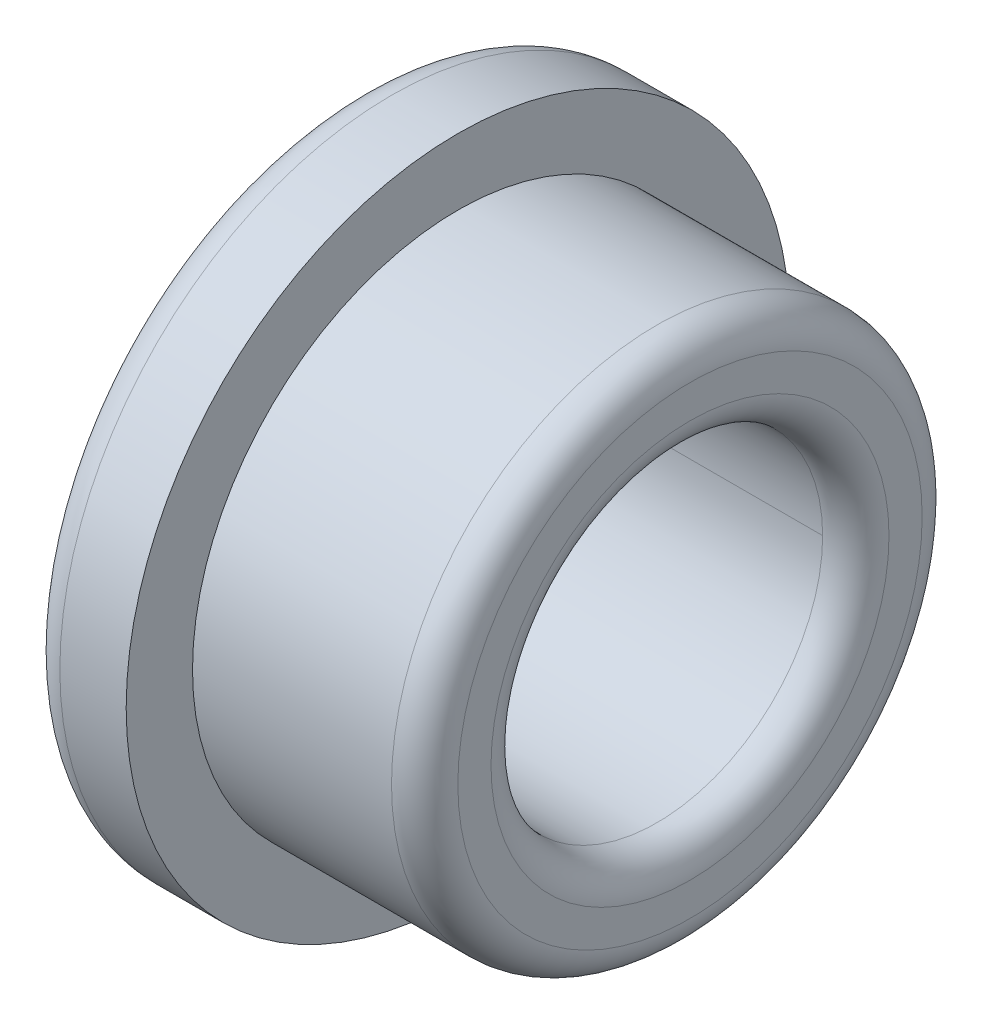
ISO-10303-21;
HEADER;
FILE_DESCRIPTION(('STEP AP214'),'2;1');
FILE_NAME('part.step','',(''),(''),'','','');
FILE_SCHEMA(('AUTOMOTIVE_DESIGN { 1 0 10303 214 1 1 1 1 }'));
ENDSEC;
DATA;
#1=APPLICATION_CONTEXT('core data for automotive mechanical design processes');
#2=APPLICATION_PROTOCOL_DEFINITION('international standard','automotive_design',2000,#1);
#3=PRODUCT_CONTEXT('',#1,'mechanical');
#4=PRODUCT('Part','Part','',(#3));
#5=PRODUCT_RELATED_PRODUCT_CATEGORY('part','',(#4));
#6=PRODUCT_DEFINITION_FORMATION('','',#4);
#7=PRODUCT_DEFINITION_CONTEXT('part definition',#1,'design');
#8=PRODUCT_DEFINITION('design','',#6,#7);
#9=PRODUCT_DEFINITION_SHAPE('','',#8);
#10=(LENGTH_UNIT() NAMED_UNIT(*) SI_UNIT(.MILLI.,.METRE.));
#11=(NAMED_UNIT(*) PLANE_ANGLE_UNIT() SI_UNIT($,.RADIAN.));
#12=(NAMED_UNIT(*) SI_UNIT($,.STERADIAN.) SOLID_ANGLE_UNIT());
#13=UNCERTAINTY_MEASURE_WITH_UNIT(LENGTH_MEASURE(1.E-05),#10,'distance_accuracy_value','');
#14=(GEOMETRIC_REPRESENTATION_CONTEXT(3) GLOBAL_UNCERTAINTY_ASSIGNED_CONTEXT((#13)) GLOBAL_UNIT_ASSIGNED_CONTEXT((#10,
#11,#12)) REPRESENTATION_CONTEXT('',''));
#15=CARTESIAN_POINT('',(0.,0.,0.));
#16=DIRECTION('',(0.,0.,1.));
#17=DIRECTION('',(1.,0.,0.));
#18=AXIS2_PLACEMENT_3D('',#15,#16,#17);
#19=CARTESIAN_POINT('',(-10.,8.,0.));
#20=DIRECTION('',(-1.,0.,0.));
#21=DIRECTION('',(0.,0.,1.));
#22=AXIS2_PLACEMENT_3D('',#19,#20,#21);
#23=CYLINDRICAL_SURFACE('',#22,5.);
#24=CARTESIAN_POINT('',(-1.00000000000001,8.,0.));
#25=DIRECTION('',(-1.,0.,0.));
#26=DIRECTION('',(0.,0.,1.));
#27=AXIS2_PLACEMENT_3D('',#24,#25,#26);
#28=CIRCLE('',#27,5.);
#29=CARTESIAN_POINT('',(-1.00000000000001,8.,5.));
#30=VERTEX_POINT('',#29);
#31=CARTESIAN_POINT('',(-1.00000000000001,8.,-5.));
#32=VERTEX_POINT('',#31);
#33=EDGE_CURVE('E68',#30,#32,#28,.T.);
#34=ORIENTED_EDGE('',*,*,#33,.F.);
#35=DIRECTION('',(-1.,0.,0.));
#36=VECTOR('',#35,1.);
#37=CARTESIAN_POINT('',(-10.,8.,5.));
#38=LINE('',#37,#36);
#39=CARTESIAN_POINT('',(-8.99999999999999,8.,5.));
#40=VERTEX_POINT('',#39);
#41=EDGE_CURVE('E11',#30,#40,#38,.T.);
#42=ORIENTED_EDGE('',*,*,#41,.T.);
#43=CARTESIAN_POINT('',(-8.99999999999999,8.,0.));
#44=DIRECTION('',(-1.,0.,0.));
#45=DIRECTION('',(0.,0.,1.));
#46=AXIS2_PLACEMENT_3D('',#43,#44,#45);
#47=CIRCLE('',#46,5.);
#48=CARTESIAN_POINT('',(-8.99999999999999,8.,-5.));
#49=VERTEX_POINT('',#48);
#50=EDGE_CURVE('E66',#40,#49,#47,.T.);
#51=ORIENTED_EDGE('',*,*,#50,.T.);
#52=DIRECTION('',(-1.,0.,0.));
#53=VECTOR('',#52,1.);
#54=CARTESIAN_POINT('',(-10.,8.,-5.));
#55=LINE('',#54,#53);
#56=EDGE_CURVE('E44',#49,#32,#55,.F.);
#57=ORIENTED_EDGE('',*,*,#56,.T.);
#58=EDGE_LOOP('',(#34,#42,#51,#57));
#59=FACE_BOUND('',#58,.T.);
#60=ADVANCED_FACE('F40',(#59),#23,.F.);
#61=CARTESIAN_POINT('',(-7.,0.,0.));
#62=DIRECTION('',(1.,0.,0.));
#63=DIRECTION('',(0.,0.,-1.));
#64=AXIS2_PLACEMENT_3D('',#61,#62,#63);
#65=PLANE('',#64);
#66=CARTESIAN_POINT('',(-7.,8.,0.));
#67=DIRECTION('',(-1.,0.,0.));
#68=DIRECTION('',(0.,0.,1.));
#69=AXIS2_PLACEMENT_3D('',#66,#67,#68);
#70=CIRCLE('',#69,8.);
#71=CARTESIAN_POINT('',(-7.,8.,8.));
#72=VERTEX_POINT('',#71);
#73=EDGE_CURVE('E109',#72,#72,#70,.T.);
#74=ORIENTED_EDGE('',*,*,#73,.T.);
#75=EDGE_LOOP('',(#74));
#76=FACE_BOUND('',#75,.T.);
#77=CARTESIAN_POINT('',(-7.,8.,0.));
#78=DIRECTION('',(-1.,0.,0.));
#79=DIRECTION('',(0.,0.,1.));
#80=AXIS2_PLACEMENT_3D('',#77,#78,#79);
#81=CIRCLE('',#80,10.);
#82=CARTESIAN_POINT('',(-7.,8.,10.));
#83=VERTEX_POINT('',#82);
#84=EDGE_CURVE('E87',#83,#83,#81,.T.);
#85=ORIENTED_EDGE('',*,*,#84,.F.);
#86=EDGE_LOOP('',(#85));
#87=FACE_BOUND('',#86,.T.);
#88=ADVANCED_FACE('F42',(#76,#87),#65,.T.);
#89=CARTESIAN_POINT('',(-10.,8.,0.));
#90=DIRECTION('',(-1.,0.,0.));
#91=DIRECTION('',(0.,0.,1.));
#92=AXIS2_PLACEMENT_3D('',#89,#90,#91);
#93=CYLINDRICAL_SURFACE('',#92,10.);
#94=ORIENTED_EDGE('',*,*,#84,.T.);
#95=EDGE_LOOP('',(#94));
#96=FACE_BOUND('',#95,.T.);
#97=CARTESIAN_POINT('',(-8.99999999999999,8.,0.));
#98=DIRECTION('',(-1.,0.,0.));
#99=DIRECTION('',(0.,0.,1.));
#100=AXIS2_PLACEMENT_3D('',#97,#98,#99);
#101=CIRCLE('',#100,10.);
#102=CARTESIAN_POINT('',(-8.99999999999999,8.,10.));
#103=VERTEX_POINT('',#102);
#104=EDGE_CURVE('E84',#103,#103,#101,.T.);
#105=ORIENTED_EDGE('',*,*,#104,.F.);
#106=EDGE_LOOP('',(#105));
#107=FACE_BOUND('',#106,.T.);
#108=ADVANCED_FACE('F96',(#96,#107),#93,.T.);
#109=CARTESIAN_POINT('',(-9.,8.,0.));
#110=DIRECTION('',(-1.,0.,0.));
#111=DIRECTION('',(0.,0.,1.));
#112=AXIS2_PLACEMENT_3D('',#109,#110,#111);
#113=TOROIDAL_SURFACE('',#112,9.,1.);
#114=ORIENTED_EDGE('',*,*,#104,.T.);
#115=EDGE_LOOP('',(#114));
#116=FACE_BOUND('',#115,.T.);
#117=CARTESIAN_POINT('',(-10.,8.,0.));
#118=DIRECTION('',(-1.,0.,0.));
#119=DIRECTION('',(0.,0.,1.));
#120=AXIS2_PLACEMENT_3D('',#117,#118,#119);
#121=CIRCLE('',#120,8.99999999999999);
#122=CARTESIAN_POINT('',(-10.,8.,8.99999999999999));
#123=VERTEX_POINT('',#122);
#124=EDGE_CURVE('E77',#123,#123,#121,.T.);
#125=ORIENTED_EDGE('',*,*,#124,.F.);
#126=EDGE_LOOP('',(#125));
#127=FACE_BOUND('',#126,.T.);
#128=ADVANCED_FACE('F105',(#116,#127),#113,.T.);
#129=CARTESIAN_POINT('',(-10.,-0.999999999999993,0.));
#130=DIRECTION('',(-1.,0.,0.));
#131=DIRECTION('',(0.,0.,1.));
#132=AXIS2_PLACEMENT_3D('',#129,#130,#131);
#133=PLANE('',#132);
#134=ORIENTED_EDGE('',*,*,#124,.T.);
#135=EDGE_LOOP('',(#134));
#136=FACE_BOUND('',#135,.T.);
#137=CARTESIAN_POINT('',(-10.,8.,0.));
#138=DIRECTION('',(-1.,0.,0.));
#139=DIRECTION('',(0.,0.,1.));
#140=AXIS2_PLACEMENT_3D('',#137,#138,#139);
#141=CIRCLE('',#140,6.00000000000001);
#142=CARTESIAN_POINT('',(-10.,8.,6.00000000000001));
#143=VERTEX_POINT('',#142);
#144=EDGE_CURVE('E75',#143,#143,#141,.T.);
#145=ORIENTED_EDGE('',*,*,#144,.F.);
#146=EDGE_LOOP('',(#145));
#147=FACE_BOUND('',#146,.T.);
#148=ADVANCED_FACE('F139',(#136,#147),#133,.T.);
#149=CARTESIAN_POINT('',(-9.,8.,0.));
#150=DIRECTION('',(-1.,0.,0.));
#151=DIRECTION('',(0.,0.,1.));
#152=AXIS2_PLACEMENT_3D('',#149,#150,#151);
#153=TOROIDAL_SURFACE('',#152,6.,1.);
#154=ORIENTED_EDGE('',*,*,#144,.T.);
#155=EDGE_LOOP('',(#154));
#156=FACE_BOUND('',#155,.T.);
#157=ORIENTED_EDGE('',*,*,#50,.F.);
#158=EDGE_CURVE('E70',#49,#40,#47,.T.);
#159=ORIENTED_EDGE('',*,*,#158,.F.);
#160=EDGE_LOOP('',(#157,#159));
#161=FACE_BOUND('',#160,.T.);
#162=ADVANCED_FACE('F74',(#156,#161),#153,.T.);
#163=ORIENTED_EDGE('',*,*,#41,.F.);
#164=EDGE_CURVE('E120',#32,#30,#28,.T.);
#165=ORIENTED_EDGE('',*,*,#164,.F.);
#166=ORIENTED_EDGE('',*,*,#56,.F.);
#167=ORIENTED_EDGE('',*,*,#158,.T.);
#168=EDGE_LOOP('',(#163,#165,#166,#167));
#169=FACE_BOUND('',#168,.T.);
#170=ADVANCED_FACE('F71',(#169),#23,.F.);
#171=CARTESIAN_POINT('',(-1.,8.,0.));
#172=DIRECTION('',(-1.,0.,0.));
#173=DIRECTION('',(0.,0.,1.));
#174=AXIS2_PLACEMENT_3D('',#171,#172,#173);
#175=TOROIDAL_SURFACE('',#174,6.,1.);
#176=ORIENTED_EDGE('',*,*,#33,.T.);
#177=ORIENTED_EDGE('',*,*,#164,.T.);
#178=EDGE_LOOP('',(#176,#177));
#179=FACE_BOUND('',#178,.T.);
#180=CARTESIAN_POINT('',(0.,8.,0.));
#181=DIRECTION('',(-1.,0.,0.));
#182=DIRECTION('',(0.,0.,1.));
#183=AXIS2_PLACEMENT_3D('',#180,#181,#182);
#184=CIRCLE('',#183,6.00000000000001);
#185=CARTESIAN_POINT('',(0.,8.,6.00000000000001));
#186=VERTEX_POINT('',#185);
#187=EDGE_CURVE('E118',#186,#186,#184,.T.);
#188=ORIENTED_EDGE('',*,*,#187,.F.);
#189=EDGE_LOOP('',(#188));
#190=FACE_BOUND('',#189,.T.);
#191=ADVANCED_FACE('F124',(#179,#190),#175,.T.);
#192=CARTESIAN_POINT('',(0.,1.99999999999999,0.));
#193=DIRECTION('',(1.,0.,0.));
#194=DIRECTION('',(0.,0.,-1.));
#195=AXIS2_PLACEMENT_3D('',#192,#193,#194);
#196=PLANE('',#195);
#197=ORIENTED_EDGE('',*,*,#187,.T.);
#198=EDGE_LOOP('',(#197));
#199=FACE_BOUND('',#198,.T.);
#200=CARTESIAN_POINT('',(0.,8.,0.));
#201=DIRECTION('',(-1.,0.,0.));
#202=DIRECTION('',(0.,0.,1.));
#203=AXIS2_PLACEMENT_3D('',#200,#201,#202);
#204=CIRCLE('',#203,7.);
#205=CARTESIAN_POINT('',(0.,8.,7.));
#206=VERTEX_POINT('',#205);
#207=EDGE_CURVE('E114',#206,#206,#204,.T.);
#208=ORIENTED_EDGE('',*,*,#207,.F.);
#209=EDGE_LOOP('',(#208));
#210=FACE_BOUND('',#209,.T.);
#211=ADVANCED_FACE('F127',(#199,#210),#196,.T.);
#212=CARTESIAN_POINT('',(-1.,8.,0.));
#213=DIRECTION('',(-1.,0.,0.));
#214=DIRECTION('',(0.,0.,1.));
#215=AXIS2_PLACEMENT_3D('',#212,#213,#214);
#216=TOROIDAL_SURFACE('',#215,7.,1.);
#217=ORIENTED_EDGE('',*,*,#207,.T.);
#218=EDGE_LOOP('',(#217));
#219=FACE_BOUND('',#218,.T.);
#220=CARTESIAN_POINT('',(-1.00000000000001,8.,0.));
#221=DIRECTION('',(-1.,0.,0.));
#222=DIRECTION('',(0.,0.,1.));
#223=AXIS2_PLACEMENT_3D('',#220,#221,#222);
#224=CIRCLE('',#223,8.);
#225=CARTESIAN_POINT('',(-1.00000000000001,8.,8.));
#226=VERTEX_POINT('',#225);
#227=EDGE_CURVE('E111',#226,#226,#224,.T.);
#228=ORIENTED_EDGE('',*,*,#227,.F.);
#229=EDGE_LOOP('',(#228));
#230=FACE_BOUND('',#229,.T.);
#231=ADVANCED_FACE('F133',(#219,#230),#216,.T.);
#232=CARTESIAN_POINT('',(-10.,8.,0.));
#233=DIRECTION('',(-1.,0.,0.));
#234=DIRECTION('',(0.,0.,1.));
#235=AXIS2_PLACEMENT_3D('',#232,#233,#234);
#236=CYLINDRICAL_SURFACE('',#235,8.);
#237=ORIENTED_EDGE('',*,*,#227,.T.);
#238=EDGE_LOOP('',(#237));
#239=FACE_BOUND('',#238,.T.);
#240=ORIENTED_EDGE('',*,*,#73,.F.);
#241=EDGE_LOOP('',(#240));
#242=FACE_BOUND('',#241,.T.);
#243=ADVANCED_FACE('F190',(#239,#242),#236,.T.);
#244=CLOSED_SHELL('',(#60,#88,#108,#128,#148,#162,#170,#191,#211,#231,#243));
#245=MANIFOLD_SOLID_BREP('B2',#244);
#246=ADVANCED_BREP_SHAPE_REPRESENTATION('',(#18,#245),#14);
#247=SHAPE_DEFINITION_REPRESENTATION(#9,#246);
ENDSEC;
END-ISO-10303-21;
